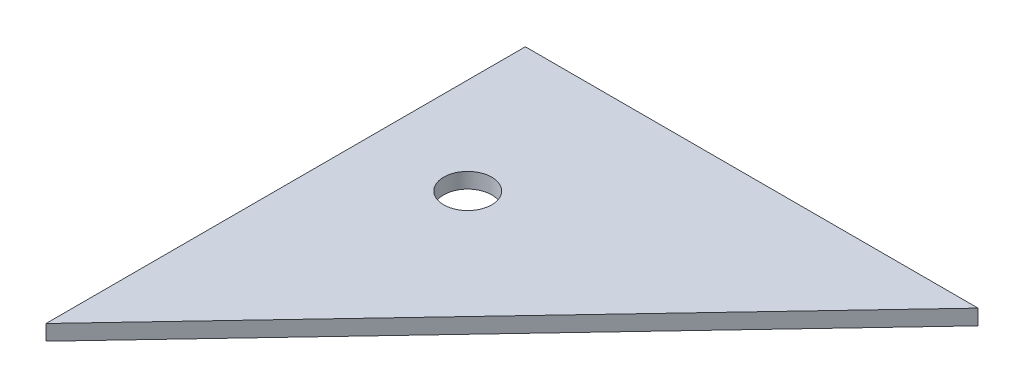
ISO-10303-21;
HEADER;
FILE_DESCRIPTION(('STEP AP214'),'2;1');
FILE_NAME('part.step','',(''),(''),'','','');
FILE_SCHEMA(('AUTOMOTIVE_DESIGN { 1 0 10303 214 1 1 1 1 }'));
ENDSEC;
DATA;
#1=APPLICATION_CONTEXT('core data for automotive mechanical design processes');
#2=APPLICATION_PROTOCOL_DEFINITION('international standard','automotive_design',2000,#1);
#3=PRODUCT_CONTEXT('',#1,'mechanical');
#4=PRODUCT('Part','Part','',(#3));
#5=PRODUCT_RELATED_PRODUCT_CATEGORY('part','',(#4));
#6=PRODUCT_DEFINITION_FORMATION('','',#4);
#7=PRODUCT_DEFINITION_CONTEXT('part definition',#1,'design');
#8=PRODUCT_DEFINITION('design','',#6,#7);
#9=PRODUCT_DEFINITION_SHAPE('','',#8);
#10=(LENGTH_UNIT() NAMED_UNIT(*) SI_UNIT(.MILLI.,.METRE.));
#11=(NAMED_UNIT(*) PLANE_ANGLE_UNIT() SI_UNIT($,.RADIAN.));
#12=(NAMED_UNIT(*) SI_UNIT($,.STERADIAN.) SOLID_ANGLE_UNIT());
#13=UNCERTAINTY_MEASURE_WITH_UNIT(LENGTH_MEASURE(1.E-05),#10,'distance_accuracy_value','');
#14=(GEOMETRIC_REPRESENTATION_CONTEXT(3) GLOBAL_UNCERTAINTY_ASSIGNED_CONTEXT((#13)) GLOBAL_UNIT_ASSIGNED_CONTEXT((#10,
#11,#12)) REPRESENTATION_CONTEXT('',''));
#15=CARTESIAN_POINT('',(0.,0.,0.));
#16=DIRECTION('',(0.,0.,1.));
#17=DIRECTION('',(1.,0.,0.));
#18=AXIS2_PLACEMENT_3D('',#15,#16,#17);
#19=CARTESIAN_POINT('',(0.,2.54,0.));
#20=DIRECTION('',(0.,1.,0.));
#21=DIRECTION('',(0.,0.,1.));
#22=AXIS2_PLACEMENT_3D('',#19,#20,#21);
#23=PLANE('',#22);
#24=DIRECTION('',(0.686580098595776,0.,-0.727054171442688));
#25=VECTOR('',#24,1.);
#26=CARTESIAN_POINT('',(74.796516699818,2.54,-79.2057905366148));
#27=LINE('',#26,#25);
#28=CARTESIAN_POINT('',(0.,2.54,0.));
#29=VERTEX_POINT('',#28);
#30=CARTESIAN_POINT('',(74.796516699818,2.54,-79.2057905366148));
#31=VERTEX_POINT('',#30);
#32=EDGE_CURVE('E76',#29,#31,#27,.T.);
#33=ORIENTED_EDGE('',*,*,#32,.T.);
#34=DIRECTION('',(-1.,0.,0.));
#35=VECTOR('',#34,1.);
#36=CARTESIAN_POINT('',(0.,2.54,-79.2057905366148));
#37=LINE('',#36,#35);
#38=CARTESIAN_POINT('',(0.,2.54,-79.2057905366148));
#39=VERTEX_POINT('',#38);
#40=EDGE_CURVE('E72',#31,#39,#37,.T.);
#41=ORIENTED_EDGE('',*,*,#40,.T.);
#42=DIRECTION('',(0.,0.,1.));
#43=VECTOR('',#42,1.);
#44=CARTESIAN_POINT('',(0.,2.54,0.));
#45=LINE('',#44,#43);
#46=EDGE_CURVE('E52',#39,#29,#45,.T.);
#47=ORIENTED_EDGE('',*,*,#46,.T.);
#48=EDGE_LOOP('',(#33,#41,#47));
#49=FACE_BOUND('',#48,.T.);
#50=CARTESIAN_POINT('',(15.875,2.54,-53.8057905366148));
#51=DIRECTION('',(0.,1.,0.));
#52=DIRECTION('',(0.,0.,1.));
#53=AXIS2_PLACEMENT_3D('',#50,#51,#52);
#54=CIRCLE('',#53,3.96875000000001);
#55=CARTESIAN_POINT('',(15.875,2.54,-49.8370405366148));
#56=VERTEX_POINT('',#55);
#57=EDGE_CURVE('E86',#56,#56,#54,.T.);
#58=ORIENTED_EDGE('',*,*,#57,.F.);
#59=EDGE_LOOP('',(#58));
#60=FACE_BOUND('',#59,.T.);
#61=ADVANCED_FACE('F35',(#49,#60),#23,.T.);
#62=CARTESIAN_POINT('',(0.,0.,0.));
#63=DIRECTION('',(0.,1.,0.));
#64=DIRECTION('',(0.,0.,1.));
#65=AXIS2_PLACEMENT_3D('',#62,#63,#64);
#66=PLANE('',#65);
#67=DIRECTION('',(0.686580098595776,0.,-0.727054171442688));
#68=VECTOR('',#67,1.);
#69=CARTESIAN_POINT('',(74.796516699818,0.,-79.2057905366148));
#70=LINE('',#69,#68);
#71=CARTESIAN_POINT('',(0.,0.,0.));
#72=VERTEX_POINT('',#71);
#73=CARTESIAN_POINT('',(74.796516699818,0.,-79.2057905366148));
#74=VERTEX_POINT('',#73);
#75=EDGE_CURVE('E83',#72,#74,#70,.T.);
#76=ORIENTED_EDGE('',*,*,#75,.F.);
#77=DIRECTION('',(0.,0.,1.));
#78=VECTOR('',#77,1.);
#79=CARTESIAN_POINT('',(0.,0.,0.));
#80=LINE('',#79,#78);
#81=CARTESIAN_POINT('',(0.,0.,-79.2057905366148));
#82=VERTEX_POINT('',#81);
#83=EDGE_CURVE('E69',#82,#72,#80,.T.);
#84=ORIENTED_EDGE('',*,*,#83,.F.);
#85=DIRECTION('',(-1.,0.,0.));
#86=VECTOR('',#85,1.);
#87=CARTESIAN_POINT('',(0.,0.,-79.2057905366148));
#88=LINE('',#87,#86);
#89=EDGE_CURVE('E64',#74,#82,#88,.T.);
#90=ORIENTED_EDGE('',*,*,#89,.F.);
#91=EDGE_LOOP('',(#76,#84,#90));
#92=FACE_BOUND('',#91,.T.);
#93=CARTESIAN_POINT('',(15.875,0.,-53.8057905366148));
#94=DIRECTION('',(0.,1.,0.));
#95=DIRECTION('',(0.,0.,1.));
#96=AXIS2_PLACEMENT_3D('',#93,#94,#95);
#97=CIRCLE('',#96,3.96875000000001);
#98=CARTESIAN_POINT('',(15.875,0.,-49.8370405366148));
#99=VERTEX_POINT('',#98);
#100=EDGE_CURVE('E90',#99,#99,#97,.T.);
#101=ORIENTED_EDGE('',*,*,#100,.T.);
#102=EDGE_LOOP('',(#101));
#103=FACE_BOUND('',#102,.T.);
#104=ADVANCED_FACE('F96',(#92,#103),#66,.F.);
#105=CARTESIAN_POINT('',(74.796516699818,2.54,-79.2057905366148));
#106=DIRECTION('',(-0.727054171442688,0.,-0.686580098595776));
#107=DIRECTION('',(-0.686580098595776,0.,0.727054171442688));
#108=AXIS2_PLACEMENT_3D('',#105,#106,#107);
#109=PLANE('',#108);
#110=ORIENTED_EDGE('',*,*,#75,.T.);
#111=DIRECTION('',(0.,-1.,0.));
#112=VECTOR('',#111,1.);
#113=CARTESIAN_POINT('',(74.796516699818,2.54,-79.2057905366148));
#114=LINE('',#113,#112);
#115=EDGE_CURVE('E11',#31,#74,#114,.T.);
#116=ORIENTED_EDGE('',*,*,#115,.F.);
#117=ORIENTED_EDGE('',*,*,#32,.F.);
#118=DIRECTION('',(0.,-1.,0.));
#119=VECTOR('',#118,1.);
#120=CARTESIAN_POINT('',(0.,2.54,0.));
#121=LINE('',#120,#119);
#122=EDGE_CURVE('E84',#29,#72,#121,.T.);
#123=ORIENTED_EDGE('',*,*,#122,.T.);
#124=EDGE_LOOP('',(#110,#116,#117,#123));
#125=FACE_BOUND('',#124,.T.);
#126=ADVANCED_FACE('F37',(#125),#109,.F.);
#127=CARTESIAN_POINT('',(0.,2.54,-79.2057905366148));
#128=DIRECTION('',(0.,0.,1.));
#129=DIRECTION('',(1.,0.,0.));
#130=AXIS2_PLACEMENT_3D('',#127,#128,#129);
#131=PLANE('',#130);
#132=ORIENTED_EDGE('',*,*,#89,.T.);
#133=DIRECTION('',(0.,-1.,0.));
#134=VECTOR('',#133,1.);
#135=CARTESIAN_POINT('',(0.,2.54,-79.2057905366148));
#136=LINE('',#135,#134);
#137=EDGE_CURVE('E44',#39,#82,#136,.T.);
#138=ORIENTED_EDGE('',*,*,#137,.F.);
#139=ORIENTED_EDGE('',*,*,#40,.F.);
#140=ORIENTED_EDGE('',*,*,#115,.T.);
#141=EDGE_LOOP('',(#132,#138,#139,#140));
#142=FACE_BOUND('',#141,.T.);
#143=ADVANCED_FACE('F73',(#142),#131,.F.);
#144=CARTESIAN_POINT('',(0.,2.54,0.));
#145=DIRECTION('',(1.,0.,0.));
#146=DIRECTION('',(0.,0.,-1.));
#147=AXIS2_PLACEMENT_3D('',#144,#145,#146);
#148=PLANE('',#147);
#149=ORIENTED_EDGE('',*,*,#83,.T.);
#150=ORIENTED_EDGE('',*,*,#122,.F.);
#151=ORIENTED_EDGE('',*,*,#46,.F.);
#152=ORIENTED_EDGE('',*,*,#137,.T.);
#153=EDGE_LOOP('',(#149,#150,#151,#152));
#154=FACE_BOUND('',#153,.T.);
#155=ADVANCED_FACE('F95',(#154),#148,.F.);
#156=CARTESIAN_POINT('',(15.875,2.54,-53.8057905366148));
#157=DIRECTION('',(0.,-1.,0.));
#158=DIRECTION('',(0.,0.,-1.));
#159=AXIS2_PLACEMENT_3D('',#156,#157,#158);
#160=CYLINDRICAL_SURFACE('',#159,3.96875000000001);
#161=ORIENTED_EDGE('',*,*,#57,.T.);
#162=EDGE_LOOP('',(#161));
#163=FACE_BOUND('',#162,.T.);
#164=ORIENTED_EDGE('',*,*,#100,.F.);
#165=EDGE_LOOP('',(#164));
#166=FACE_BOUND('',#165,.T.);
#167=ADVANCED_FACE('F104',(#163,#166),#160,.F.);
#168=CLOSED_SHELL('',(#61,#104,#126,#143,#155,#167));
#169=MANIFOLD_SOLID_BREP('B2',#168);
#170=ADVANCED_BREP_SHAPE_REPRESENTATION('',(#18,#169),#14);
#171=SHAPE_DEFINITION_REPRESENTATION(#9,#170);
ENDSEC;
END-ISO-10303-21;
